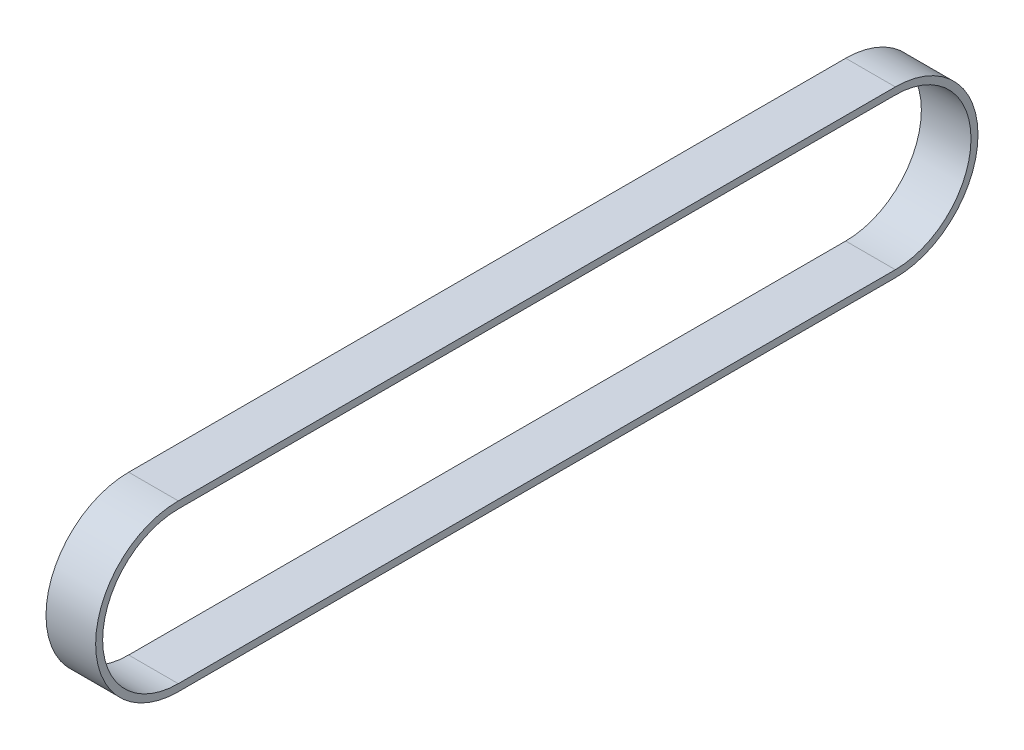
ISO-10303-21;
HEADER;
FILE_DESCRIPTION(('STEP AP214'),'2;1');
FILE_NAME('part.step','',(''),(''),'','','');
FILE_SCHEMA(('AUTOMOTIVE_DESIGN { 1 0 10303 214 1 1 1 1 }'));
ENDSEC;
DATA;
#1=APPLICATION_CONTEXT('core data for automotive mechanical design processes');
#2=APPLICATION_PROTOCOL_DEFINITION('international standard','automotive_design',2000,#1);
#3=PRODUCT_CONTEXT('',#1,'mechanical');
#4=PRODUCT('Part','Part','',(#3));
#5=PRODUCT_RELATED_PRODUCT_CATEGORY('part','',(#4));
#6=PRODUCT_DEFINITION_FORMATION('','',#4);
#7=PRODUCT_DEFINITION_CONTEXT('part definition',#1,'design');
#8=PRODUCT_DEFINITION('design','',#6,#7);
#9=PRODUCT_DEFINITION_SHAPE('','',#8);
#10=(LENGTH_UNIT() NAMED_UNIT(*) SI_UNIT(.MILLI.,.METRE.));
#11=(NAMED_UNIT(*) PLANE_ANGLE_UNIT() SI_UNIT($,.RADIAN.));
#12=(NAMED_UNIT(*) SI_UNIT($,.STERADIAN.) SOLID_ANGLE_UNIT());
#13=UNCERTAINTY_MEASURE_WITH_UNIT(LENGTH_MEASURE(1.E-05),#10,'distance_accuracy_value','');
#14=(GEOMETRIC_REPRESENTATION_CONTEXT(3) GLOBAL_UNCERTAINTY_ASSIGNED_CONTEXT((#13)) GLOBAL_UNIT_ASSIGNED_CONTEXT((#10,
#11,#12)) REPRESENTATION_CONTEXT('',''));
#15=CARTESIAN_POINT('',(0.,0.,0.));
#16=DIRECTION('',(0.,0.,1.));
#17=DIRECTION('',(1.,0.,0.));
#18=AXIS2_PLACEMENT_3D('',#15,#16,#17);
#19=CARTESIAN_POINT('',(9.,0.,0.));
#20=DIRECTION('',(1.,0.,0.));
#21=DIRECTION('',(0.,0.,-1.));
#22=AXIS2_PLACEMENT_3D('',#19,#20,#21);
#23=PLANE('',#22);
#24=CARTESIAN_POINT('',(9.,0.,0.));
#25=DIRECTION('',(1.,0.,0.));
#26=DIRECTION('',(0.,0.,-1.));
#27=AXIS2_PLACEMENT_3D('',#24,#25,#26);
#28=CIRCLE('',#27,14.986);
#29=CARTESIAN_POINT('',(9.,14.986,0.));
#30=VERTEX_POINT('',#29);
#31=CARTESIAN_POINT('',(9.,-14.986,0.));
#32=VERTEX_POINT('',#31);
#33=EDGE_CURVE('E158',#30,#32,#28,.T.);
#34=ORIENTED_EDGE('',*,*,#33,.T.);
#35=DIRECTION('',(0.,0.,-1.));
#36=VECTOR('',#35,1.);
#37=CARTESIAN_POINT('',(9.,-14.986,-130.));
#38=LINE('',#37,#36);
#39=CARTESIAN_POINT('',(9.,-14.986,-130.));
#40=VERTEX_POINT('',#39);
#41=EDGE_CURVE('E161',#32,#40,#38,.T.);
#42=ORIENTED_EDGE('',*,*,#41,.T.);
#43=CARTESIAN_POINT('',(9.,0.,-130.));
#44=DIRECTION('',(1.,0.,0.));
#45=DIRECTION('',(0.,0.,-1.));
#46=AXIS2_PLACEMENT_3D('',#43,#44,#45);
#47=CIRCLE('',#46,14.986);
#48=CARTESIAN_POINT('',(9.,14.986,-130.));
#49=VERTEX_POINT('',#48);
#50=EDGE_CURVE('E164',#40,#49,#47,.T.);
#51=ORIENTED_EDGE('',*,*,#50,.T.);
#52=DIRECTION('',(0.,0.,1.));
#53=VECTOR('',#52,1.);
#54=CARTESIAN_POINT('',(9.,14.986,0.));
#55=LINE('',#54,#53);
#56=EDGE_CURVE('E166',#49,#30,#55,.T.);
#57=ORIENTED_EDGE('',*,*,#56,.T.);
#58=EDGE_LOOP('',(#34,#42,#51,#57));
#59=FACE_BOUND('',#58,.T.);
#60=DIRECTION('',(0.,0.,-1.));
#61=VECTOR('',#60,1.);
#62=CARTESIAN_POINT('',(9.,-13.716,-130.));
#63=LINE('',#62,#61);
#64=CARTESIAN_POINT('',(9.,-13.716,0.));
#65=VERTEX_POINT('',#64);
#66=CARTESIAN_POINT('',(9.,-13.716,-130.));
#67=VERTEX_POINT('',#66);
#68=EDGE_CURVE('E130',#65,#67,#63,.T.);
#69=ORIENTED_EDGE('',*,*,#68,.F.);
#70=CARTESIAN_POINT('',(9.,0.,0.));
#71=DIRECTION('',(1.,0.,0.));
#72=DIRECTION('',(0.,0.,-1.));
#73=AXIS2_PLACEMENT_3D('',#70,#71,#72);
#74=CIRCLE('',#73,13.716);
#75=CARTESIAN_POINT('',(9.,13.716,0.));
#76=VERTEX_POINT('',#75);
#77=EDGE_CURVE('E122',#76,#65,#74,.T.);
#78=ORIENTED_EDGE('',*,*,#77,.F.);
#79=DIRECTION('',(0.,0.,1.));
#80=VECTOR('',#79,1.);
#81=CARTESIAN_POINT('',(9.,13.716,0.));
#82=LINE('',#81,#80);
#83=CARTESIAN_POINT('',(9.,13.716,-130.));
#84=VERTEX_POINT('',#83);
#85=EDGE_CURVE('E144',#84,#76,#82,.T.);
#86=ORIENTED_EDGE('',*,*,#85,.F.);
#87=CARTESIAN_POINT('',(9.,0.,-130.));
#88=DIRECTION('',(1.,0.,0.));
#89=DIRECTION('',(0.,0.,-1.));
#90=AXIS2_PLACEMENT_3D('',#87,#88,#89);
#91=CIRCLE('',#90,13.716);
#92=EDGE_CURVE('E142',#67,#84,#91,.T.);
#93=ORIENTED_EDGE('',*,*,#92,.F.);
#94=EDGE_LOOP('',(#69,#78,#86,#93));
#95=FACE_BOUND('',#94,.T.);
#96=ADVANCED_FACE('F57',(#59,#95),#23,.T.);
#97=CARTESIAN_POINT('',(0.,0.,0.));
#98=DIRECTION('',(1.,0.,0.));
#99=DIRECTION('',(0.,0.,-1.));
#100=AXIS2_PLACEMENT_3D('',#97,#98,#99);
#101=PLANE('',#100);
#102=CARTESIAN_POINT('',(0.,0.,0.));
#103=DIRECTION('',(1.,0.,0.));
#104=DIRECTION('',(0.,0.,-1.));
#105=AXIS2_PLACEMENT_3D('',#102,#103,#104);
#106=CIRCLE('',#105,14.986);
#107=CARTESIAN_POINT('',(0.,14.986,0.));
#108=VERTEX_POINT('',#107);
#109=CARTESIAN_POINT('',(0.,-14.986,0.));
#110=VERTEX_POINT('',#109);
#111=EDGE_CURVE('E138',#108,#110,#106,.T.);
#112=ORIENTED_EDGE('',*,*,#111,.F.);
#113=DIRECTION('',(0.,0.,1.));
#114=VECTOR('',#113,1.);
#115=CARTESIAN_POINT('',(0.,14.986,0.));
#116=LINE('',#115,#114);
#117=CARTESIAN_POINT('',(0.,14.986,-130.));
#118=VERTEX_POINT('',#117);
#119=EDGE_CURVE('E162',#118,#108,#116,.T.);
#120=ORIENTED_EDGE('',*,*,#119,.F.);
#121=CARTESIAN_POINT('',(0.,0.,-130.));
#122=DIRECTION('',(1.,0.,0.));
#123=DIRECTION('',(0.,0.,-1.));
#124=AXIS2_PLACEMENT_3D('',#121,#122,#123);
#125=CIRCLE('',#124,14.986);
#126=CARTESIAN_POINT('',(0.,-14.986,-130.));
#127=VERTEX_POINT('',#126);
#128=EDGE_CURVE('E173',#127,#118,#125,.T.);
#129=ORIENTED_EDGE('',*,*,#128,.F.);
#130=DIRECTION('',(0.,0.,-1.));
#131=VECTOR('',#130,1.);
#132=CARTESIAN_POINT('',(0.,-14.986,-130.));
#133=LINE('',#132,#131);
#134=EDGE_CURVE('E171',#110,#127,#133,.T.);
#135=ORIENTED_EDGE('',*,*,#134,.F.);
#136=EDGE_LOOP('',(#112,#120,#129,#135));
#137=FACE_BOUND('',#136,.T.);
#138=CARTESIAN_POINT('',(0.,0.,0.));
#139=DIRECTION('',(1.,0.,0.));
#140=DIRECTION('',(0.,0.,-1.));
#141=AXIS2_PLACEMENT_3D('',#138,#139,#140);
#142=CIRCLE('',#141,13.716);
#143=CARTESIAN_POINT('',(0.,13.716,0.));
#144=VERTEX_POINT('',#143);
#145=CARTESIAN_POINT('',(0.,-13.716,0.));
#146=VERTEX_POINT('',#145);
#147=EDGE_CURVE('E80',#144,#146,#142,.T.);
#148=ORIENTED_EDGE('',*,*,#147,.T.);
#149=DIRECTION('',(0.,0.,-1.));
#150=VECTOR('',#149,1.);
#151=CARTESIAN_POINT('',(0.,-13.716,-130.));
#152=LINE('',#151,#150);
#153=CARTESIAN_POINT('',(0.,-13.716,-130.));
#154=VERTEX_POINT('',#153);
#155=EDGE_CURVE('E137',#146,#154,#152,.T.);
#156=ORIENTED_EDGE('',*,*,#155,.T.);
#157=CARTESIAN_POINT('',(0.,0.,-130.));
#158=DIRECTION('',(1.,0.,0.));
#159=DIRECTION('',(0.,0.,-1.));
#160=AXIS2_PLACEMENT_3D('',#157,#158,#159);
#161=CIRCLE('',#160,13.716);
#162=CARTESIAN_POINT('',(0.,13.716,-130.));
#163=VERTEX_POINT('',#162);
#164=EDGE_CURVE('E150',#154,#163,#161,.T.);
#165=ORIENTED_EDGE('',*,*,#164,.T.);
#166=DIRECTION('',(0.,0.,1.));
#167=VECTOR('',#166,1.);
#168=CARTESIAN_POINT('',(0.,13.716,0.));
#169=LINE('',#168,#167);
#170=EDGE_CURVE('E131',#163,#144,#169,.T.);
#171=ORIENTED_EDGE('',*,*,#170,.T.);
#172=EDGE_LOOP('',(#148,#156,#165,#171));
#173=FACE_BOUND('',#172,.T.);
#174=ADVANCED_FACE('F191',(#137,#173),#101,.F.);
#175=CARTESIAN_POINT('',(9.,0.,0.));
#176=DIRECTION('',(-1.,0.,0.));
#177=DIRECTION('',(0.,0.,1.));
#178=AXIS2_PLACEMENT_3D('',#175,#176,#177);
#179=CYLINDRICAL_SURFACE('',#178,14.986);
#180=ORIENTED_EDGE('',*,*,#111,.T.);
#181=DIRECTION('',(-1.,0.,0.));
#182=VECTOR('',#181,1.);
#183=CARTESIAN_POINT('',(9.,-14.986,0.));
#184=LINE('',#183,#182);
#185=EDGE_CURVE('E12',#32,#110,#184,.T.);
#186=ORIENTED_EDGE('',*,*,#185,.F.);
#187=ORIENTED_EDGE('',*,*,#33,.F.);
#188=DIRECTION('',(-1.,0.,0.));
#189=VECTOR('',#188,1.);
#190=CARTESIAN_POINT('',(9.,14.986,0.));
#191=LINE('',#190,#189);
#192=EDGE_CURVE('E168',#30,#108,#191,.T.);
#193=ORIENTED_EDGE('',*,*,#192,.T.);
#194=EDGE_LOOP('',(#180,#186,#187,#193));
#195=FACE_BOUND('',#194,.T.);
#196=ADVANCED_FACE('F59',(#195),#179,.T.);
#197=CARTESIAN_POINT('',(9.,-14.986,-130.));
#198=DIRECTION('',(0.,1.,0.));
#199=DIRECTION('',(0.,0.,1.));
#200=AXIS2_PLACEMENT_3D('',#197,#198,#199);
#201=PLANE('',#200);
#202=ORIENTED_EDGE('',*,*,#134,.T.);
#203=DIRECTION('',(-1.,0.,0.));
#204=VECTOR('',#203,1.);
#205=CARTESIAN_POINT('',(9.,-14.986,-130.));
#206=LINE('',#205,#204);
#207=EDGE_CURVE('E65',#40,#127,#206,.T.);
#208=ORIENTED_EDGE('',*,*,#207,.F.);
#209=ORIENTED_EDGE('',*,*,#41,.F.);
#210=ORIENTED_EDGE('',*,*,#185,.T.);
#211=EDGE_LOOP('',(#202,#208,#209,#210));
#212=FACE_BOUND('',#211,.T.);
#213=ADVANCED_FACE('F201',(#212),#201,.F.);
#214=CARTESIAN_POINT('',(9.,0.,-130.));
#215=DIRECTION('',(-1.,0.,0.));
#216=DIRECTION('',(0.,0.,1.));
#217=AXIS2_PLACEMENT_3D('',#214,#215,#216);
#218=CYLINDRICAL_SURFACE('',#217,14.986);
#219=ORIENTED_EDGE('',*,*,#128,.T.);
#220=DIRECTION('',(-1.,0.,0.));
#221=VECTOR('',#220,1.);
#222=CARTESIAN_POINT('',(9.,14.986,-130.));
#223=LINE('',#222,#221);
#224=EDGE_CURVE('E178',#49,#118,#223,.T.);
#225=ORIENTED_EDGE('',*,*,#224,.F.);
#226=ORIENTED_EDGE('',*,*,#50,.F.);
#227=ORIENTED_EDGE('',*,*,#207,.T.);
#228=EDGE_LOOP('',(#219,#225,#226,#227));
#229=FACE_BOUND('',#228,.T.);
#230=ADVANCED_FACE('F185',(#229),#218,.T.);
#231=CARTESIAN_POINT('',(9.,14.986,0.));
#232=DIRECTION('',(0.,-1.,0.));
#233=DIRECTION('',(0.,0.,-1.));
#234=AXIS2_PLACEMENT_3D('',#231,#232,#233);
#235=PLANE('',#234);
#236=ORIENTED_EDGE('',*,*,#119,.T.);
#237=ORIENTED_EDGE('',*,*,#192,.F.);
#238=ORIENTED_EDGE('',*,*,#56,.F.);
#239=ORIENTED_EDGE('',*,*,#224,.T.);
#240=EDGE_LOOP('',(#236,#237,#238,#239));
#241=FACE_BOUND('',#240,.T.);
#242=ADVANCED_FACE('F195',(#241),#235,.F.);
#243=CARTESIAN_POINT('',(9.,0.,0.));
#244=DIRECTION('',(-1.,0.,0.));
#245=DIRECTION('',(0.,0.,1.));
#246=AXIS2_PLACEMENT_3D('',#243,#244,#245);
#247=CYLINDRICAL_SURFACE('',#246,13.716);
#248=ORIENTED_EDGE('',*,*,#147,.F.);
#249=DIRECTION('',(-1.,0.,0.));
#250=VECTOR('',#249,1.);
#251=CARTESIAN_POINT('',(9.,13.716,0.));
#252=LINE('',#251,#250);
#253=EDGE_CURVE('E126',#76,#144,#252,.T.);
#254=ORIENTED_EDGE('',*,*,#253,.F.);
#255=ORIENTED_EDGE('',*,*,#77,.T.);
#256=DIRECTION('',(-1.,0.,0.));
#257=VECTOR('',#256,1.);
#258=CARTESIAN_POINT('',(9.,-13.716,0.));
#259=LINE('',#258,#257);
#260=EDGE_CURVE('E125',#65,#146,#259,.T.);
#261=ORIENTED_EDGE('',*,*,#260,.T.);
#262=EDGE_LOOP('',(#248,#254,#255,#261));
#263=FACE_BOUND('',#262,.T.);
#264=ADVANCED_FACE('F124',(#263),#247,.F.);
#265=CARTESIAN_POINT('',(9.,-13.716,-130.));
#266=DIRECTION('',(0.,1.,0.));
#267=DIRECTION('',(0.,0.,1.));
#268=AXIS2_PLACEMENT_3D('',#265,#266,#267);
#269=PLANE('',#268);
#270=ORIENTED_EDGE('',*,*,#155,.F.);
#271=ORIENTED_EDGE('',*,*,#260,.F.);
#272=ORIENTED_EDGE('',*,*,#68,.T.);
#273=DIRECTION('',(-1.,0.,0.));
#274=VECTOR('',#273,1.);
#275=CARTESIAN_POINT('',(9.,-13.716,-130.));
#276=LINE('',#275,#274);
#277=EDGE_CURVE('E139',#67,#154,#276,.T.);
#278=ORIENTED_EDGE('',*,*,#277,.T.);
#279=EDGE_LOOP('',(#270,#271,#272,#278));
#280=FACE_BOUND('',#279,.T.);
#281=ADVANCED_FACE('F134',(#280),#269,.T.);
#282=CARTESIAN_POINT('',(9.,0.,-130.));
#283=DIRECTION('',(-1.,0.,0.));
#284=DIRECTION('',(0.,0.,1.));
#285=AXIS2_PLACEMENT_3D('',#282,#283,#284);
#286=CYLINDRICAL_SURFACE('',#285,13.716);
#287=ORIENTED_EDGE('',*,*,#164,.F.);
#288=ORIENTED_EDGE('',*,*,#277,.F.);
#289=ORIENTED_EDGE('',*,*,#92,.T.);
#290=DIRECTION('',(-1.,0.,0.));
#291=VECTOR('',#290,1.);
#292=CARTESIAN_POINT('',(9.,13.716,-130.));
#293=LINE('',#292,#291);
#294=EDGE_CURVE('E72',#84,#163,#293,.T.);
#295=ORIENTED_EDGE('',*,*,#294,.T.);
#296=EDGE_LOOP('',(#287,#288,#289,#295));
#297=FACE_BOUND('',#296,.T.);
#298=ADVANCED_FACE('F224',(#297),#286,.F.);
#299=CARTESIAN_POINT('',(9.,13.716,0.));
#300=DIRECTION('',(0.,-1.,0.));
#301=DIRECTION('',(0.,0.,-1.));
#302=AXIS2_PLACEMENT_3D('',#299,#300,#301);
#303=PLANE('',#302);
#304=ORIENTED_EDGE('',*,*,#170,.F.);
#305=ORIENTED_EDGE('',*,*,#294,.F.);
#306=ORIENTED_EDGE('',*,*,#85,.T.);
#307=ORIENTED_EDGE('',*,*,#253,.T.);
#308=EDGE_LOOP('',(#304,#305,#306,#307));
#309=FACE_BOUND('',#308,.T.);
#310=ADVANCED_FACE('F228',(#309),#303,.T.);
#311=CLOSED_SHELL('',(#96,#174,#196,#213,#230,#242,#264,#281,#298,#310));
#312=MANIFOLD_SOLID_BREP('B2',#311);
#313=ADVANCED_BREP_SHAPE_REPRESENTATION('',(#18,#312),#14);
#314=SHAPE_DEFINITION_REPRESENTATION(#9,#313);
ENDSEC;
END-ISO-10303-21;
